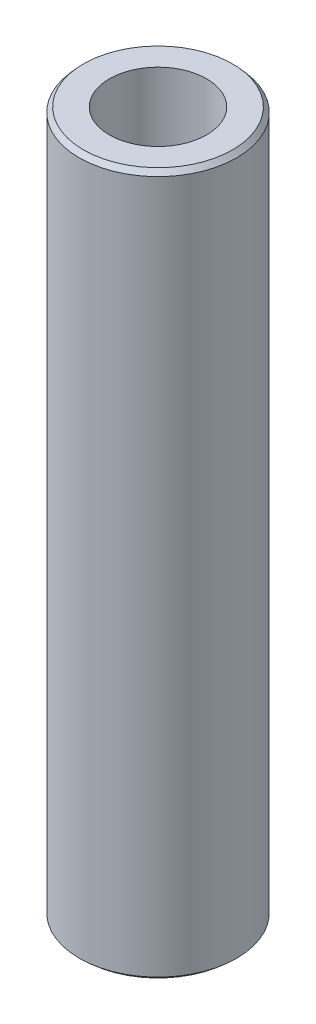
ISO-10303-21;
HEADER;
FILE_DESCRIPTION(('STEP AP214'),'2;1');
FILE_NAME('part.step','',(''),(''),'','','');
FILE_SCHEMA(('AUTOMOTIVE_DESIGN { 1 0 10303 214 1 1 1 1 }'));
ENDSEC;
DATA;
#1=APPLICATION_CONTEXT('core data for automotive mechanical design processes');
#2=APPLICATION_PROTOCOL_DEFINITION('international standard','automotive_design',2000,#1);
#3=PRODUCT_CONTEXT('',#1,'mechanical');
#4=PRODUCT('Part','Part','',(#3));
#5=PRODUCT_RELATED_PRODUCT_CATEGORY('part','',(#4));
#6=PRODUCT_DEFINITION_FORMATION('','',#4);
#7=PRODUCT_DEFINITION_CONTEXT('part definition',#1,'design');
#8=PRODUCT_DEFINITION('design','',#6,#7);
#9=PRODUCT_DEFINITION_SHAPE('','',#8);
#10=(LENGTH_UNIT() NAMED_UNIT(*) SI_UNIT(.MILLI.,.METRE.));
#11=(NAMED_UNIT(*) PLANE_ANGLE_UNIT() SI_UNIT($,.RADIAN.));
#12=(NAMED_UNIT(*) SI_UNIT($,.STERADIAN.) SOLID_ANGLE_UNIT());
#13=UNCERTAINTY_MEASURE_WITH_UNIT(LENGTH_MEASURE(1.E-05),#10,'distance_accuracy_value','');
#14=(GEOMETRIC_REPRESENTATION_CONTEXT(3) GLOBAL_UNCERTAINTY_ASSIGNED_CONTEXT((#13)) GLOBAL_UNIT_ASSIGNED_CONTEXT((#10,
#11,#12)) REPRESENTATION_CONTEXT('',''));
#15=CARTESIAN_POINT('',(0.,0.,0.));
#16=DIRECTION('',(0.,0.,1.));
#17=DIRECTION('',(1.,0.,0.));
#18=AXIS2_PLACEMENT_3D('',#15,#16,#17);
#19=CARTESIAN_POINT('',(0.,133.782797679921,0.));
#20=DIRECTION('',(0.,-1.,0.));
#21=DIRECTION('',(0.,0.,-1.));
#22=AXIS2_PLACEMENT_3D('',#19,#20,#21);
#23=CYLINDRICAL_SURFACE('',#22,15.);
#24=CARTESIAN_POINT('',(0.,132.869338257908,0.));
#25=DIRECTION('',(0.,1.,0.));
#26=DIRECTION('',(0.,0.,1.));
#27=AXIS2_PLACEMENT_3D('',#24,#25,#26);
#28=CIRCLE('',#27,15.);
#29=CARTESIAN_POINT('',(0.,132.869338257908,15.));
#30=VERTEX_POINT('',#29);
#31=EDGE_CURVE('E50',#30,#30,#28,.F.);
#32=ORIENTED_EDGE('',*,*,#31,.T.);
#33=EDGE_LOOP('',(#32));
#34=FACE_BOUND('',#33,.T.);
#35=CARTESIAN_POINT('',(0.,0.800807564073941,0.));
#36=DIRECTION('',(0.,1.,0.));
#37=DIRECTION('',(0.,0.,1.));
#38=AXIS2_PLACEMENT_3D('',#35,#36,#37);
#39=CIRCLE('',#38,15.);
#40=CARTESIAN_POINT('',(0.,0.800807564073941,15.));
#41=VERTEX_POINT('',#40);
#42=EDGE_CURVE('E51',#41,#41,#39,.T.);
#43=ORIENTED_EDGE('',*,*,#42,.T.);
#44=EDGE_LOOP('',(#43));
#45=FACE_BOUND('',#44,.T.);
#46=ADVANCED_FACE('F39',(#34,#45),#23,.T.);
#47=CARTESIAN_POINT('',(0.,133.782797679921,0.));
#48=DIRECTION('',(0.,1.,0.));
#49=DIRECTION('',(0.,0.,1.));
#50=AXIS2_PLACEMENT_3D('',#47,#48,#49);
#51=PLANE('',#50);
#52=CARTESIAN_POINT('',(0.,133.782797679921,0.));
#53=DIRECTION('',(0.,1.,0.));
#54=DIRECTION('',(0.,0.,1.));
#55=AXIS2_PLACEMENT_3D('',#52,#53,#54);
#56=CIRCLE('',#55,14.199192435926);
#57=CARTESIAN_POINT('',(0.,133.782797679921,14.199192435926));
#58=VERTEX_POINT('',#57);
#59=EDGE_CURVE('E54',#58,#58,#56,.T.);
#60=ORIENTED_EDGE('',*,*,#59,.T.);
#61=EDGE_LOOP('',(#60));
#62=FACE_BOUND('',#61,.T.);
#63=CARTESIAN_POINT('',(0.,133.782797679921,0.));
#64=DIRECTION('',(0.,1.,0.));
#65=DIRECTION('',(0.,0.,1.));
#66=AXIS2_PLACEMENT_3D('',#63,#64,#65);
#67=CIRCLE('',#66,9.26676782792271);
#68=CARTESIAN_POINT('',(0.,133.782797679921,9.26676782792271));
#69=VERTEX_POINT('',#68);
#70=EDGE_CURVE('E58',#69,#69,#67,.T.);
#71=ORIENTED_EDGE('',*,*,#70,.F.);
#72=EDGE_LOOP('',(#71));
#73=FACE_BOUND('',#72,.T.);
#74=ADVANCED_FACE('F69',(#62,#73),#51,.T.);
#75=CARTESIAN_POINT('',(0.,0.,0.));
#76=DIRECTION('',(0.,1.,0.));
#77=DIRECTION('',(0.,0.,1.));
#78=AXIS2_PLACEMENT_3D('',#75,#76,#77);
#79=PLANE('',#78);
#80=CARTESIAN_POINT('',(0.,0.,0.));
#81=DIRECTION('',(0.,1.,0.));
#82=DIRECTION('',(0.,0.,1.));
#83=AXIS2_PLACEMENT_3D('',#80,#81,#82);
#84=CIRCLE('',#83,14.0865405779873);
#85=CARTESIAN_POINT('',(0.,0.,14.0865405779873));
#86=VERTEX_POINT('',#85);
#87=EDGE_CURVE('E10',#86,#86,#84,.F.);
#88=ORIENTED_EDGE('',*,*,#87,.T.);
#89=EDGE_LOOP('',(#88));
#90=FACE_BOUND('',#89,.T.);
#91=CARTESIAN_POINT('',(0.,0.,0.));
#92=DIRECTION('',(0.,1.,0.));
#93=DIRECTION('',(0.,0.,1.));
#94=AXIS2_PLACEMENT_3D('',#91,#92,#93);
#95=CIRCLE('',#94,9.26676782792271);
#96=CARTESIAN_POINT('',(0.,0.,9.26676782792271));
#97=VERTEX_POINT('',#96);
#98=EDGE_CURVE('E63',#97,#97,#95,.T.);
#99=ORIENTED_EDGE('',*,*,#98,.T.);
#100=EDGE_LOOP('',(#99));
#101=FACE_BOUND('',#100,.T.);
#102=ADVANCED_FACE('F75',(#90,#101),#79,.F.);
#103=CARTESIAN_POINT('',(0.,133.782797679921,0.));
#104=DIRECTION('',(0.,-1.,0.));
#105=DIRECTION('',(0.,0.,-1.));
#106=AXIS2_PLACEMENT_3D('',#103,#104,#105);
#107=CYLINDRICAL_SURFACE('',#106,9.26676782792271);
#108=ORIENTED_EDGE('',*,*,#70,.T.);
#109=EDGE_LOOP('',(#108));
#110=FACE_BOUND('',#109,.T.);
#111=ORIENTED_EDGE('',*,*,#98,.F.);
#112=EDGE_LOOP('',(#111));
#113=FACE_BOUND('',#112,.T.);
#114=ADVANCED_FACE('F70',(#110,#113),#107,.F.);
#115=CARTESIAN_POINT('',(0.,133.782797679921,0.));
#116=DIRECTION('',(0.,-1.,0.));
#117=DIRECTION('',(0.,0.,-1.));
#118=AXIS2_PLACEMENT_3D('',#115,#116,#117);
#119=CONICAL_SURFACE('',#118,14.199192435926,0.71977821022425);
#120=ORIENTED_EDGE('',*,*,#31,.F.);
#121=EDGE_LOOP('',(#120));
#122=FACE_BOUND('',#121,.T.);
#123=ORIENTED_EDGE('',*,*,#59,.F.);
#124=EDGE_LOOP('',(#123));
#125=FACE_BOUND('',#124,.T.);
#126=ADVANCED_FACE('F81',(#122,#125),#119,.T.);
#127=CARTESIAN_POINT('',(0.,0.800807564073941,0.));
#128=DIRECTION('',(0.,1.,0.));
#129=DIRECTION('',(0.,0.,1.));
#130=AXIS2_PLACEMENT_3D('',#127,#128,#129);
#131=CONICAL_SURFACE('',#130,15.,0.851018116570648);
#132=ORIENTED_EDGE('',*,*,#87,.F.);
#133=EDGE_LOOP('',(#132));
#134=FACE_BOUND('',#133,.T.);
#135=ORIENTED_EDGE('',*,*,#42,.F.);
#136=EDGE_LOOP('',(#135));
#137=FACE_BOUND('',#136,.T.);
#138=ADVANCED_FACE('F45',(#134,#137),#131,.T.);
#139=CLOSED_SHELL('',(#46,#74,#102,#114,#126,#138));
#140=MANIFOLD_SOLID_BREP('B2',#139);
#141=ADVANCED_BREP_SHAPE_REPRESENTATION('',(#18,#140),#14);
#142=SHAPE_DEFINITION_REPRESENTATION(#9,#141);
ENDSEC;
END-ISO-10303-21;
